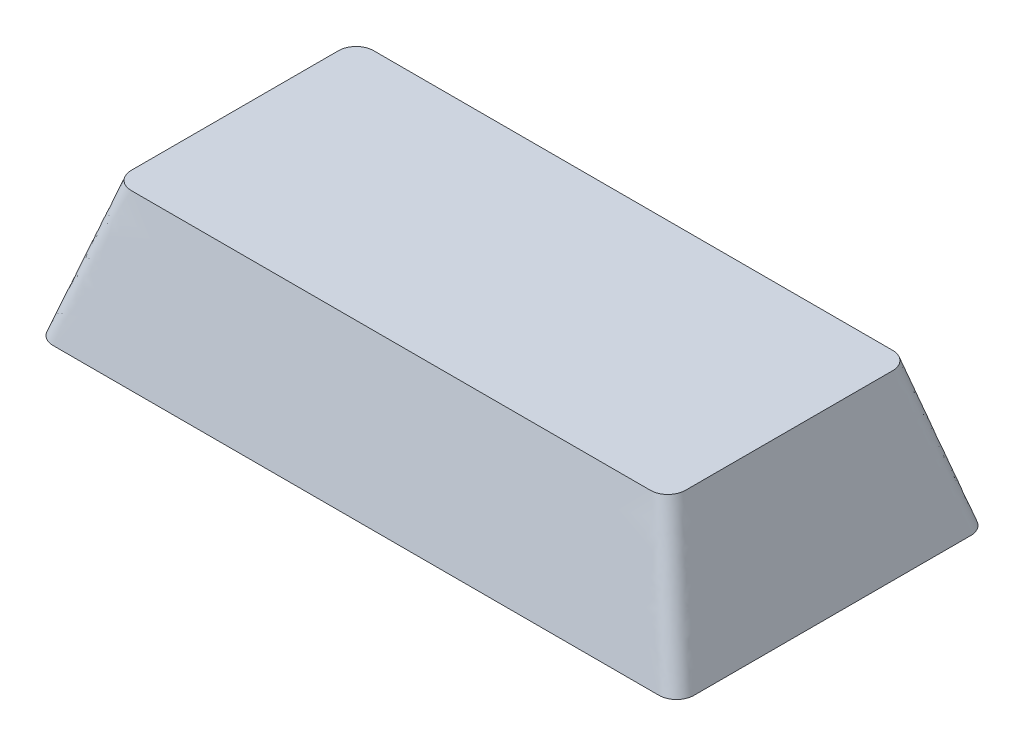
ISO-10303-21;
HEADER;
FILE_DESCRIPTION(('STEP AP214'),'2;1');
FILE_NAME('part.step','',(''),(''),'','','');
FILE_SCHEMA(('AUTOMOTIVE_DESIGN { 1 0 10303 214 1 1 1 1 }'));
ENDSEC;
DATA;
#1=APPLICATION_CONTEXT('core data for automotive mechanical design processes');
#2=APPLICATION_PROTOCOL_DEFINITION('international standard','automotive_design',2000,#1);
#3=PRODUCT_CONTEXT('',#1,'mechanical');
#4=PRODUCT('Part','Part','',(#3));
#5=PRODUCT_RELATED_PRODUCT_CATEGORY('part','',(#4));
#6=PRODUCT_DEFINITION_FORMATION('','',#4);
#7=PRODUCT_DEFINITION_CONTEXT('part definition',#1,'design');
#8=PRODUCT_DEFINITION('design','',#6,#7);
#9=PRODUCT_DEFINITION_SHAPE('','',#8);
#10=(LENGTH_UNIT() NAMED_UNIT(*) SI_UNIT(.MILLI.,.METRE.));
#11=(NAMED_UNIT(*) PLANE_ANGLE_UNIT() SI_UNIT($,.RADIAN.));
#12=(NAMED_UNIT(*) SI_UNIT($,.STERADIAN.) SOLID_ANGLE_UNIT());
#13=UNCERTAINTY_MEASURE_WITH_UNIT(LENGTH_MEASURE(1.E-05),#10,'distance_accuracy_value','');
#14=(GEOMETRIC_REPRESENTATION_CONTEXT(3) GLOBAL_UNCERTAINTY_ASSIGNED_CONTEXT((#13)) GLOBAL_UNIT_ASSIGNED_CONTEXT((#10,
#11,#12)) REPRESENTATION_CONTEXT('',''));
#15=CARTESIAN_POINT('',(0.,0.,0.));
#16=DIRECTION('',(0.,0.,1.));
#17=DIRECTION('',(1.,0.,0.));
#18=AXIS2_PLACEMENT_3D('',#15,#16,#17);
#19=CARTESIAN_POINT('',(-17.4879,0.,-7.9883));
#20=DIRECTION('',(0.,-1.,0.));
#21=DIRECTION('',(0.,0.,-1.));
#22=AXIS2_PLACEMENT_3D('',#19,#20,#21);
#23=PLANE('',#22);
#24=CARTESIAN_POINT('',(-17.4879,0.,-7.9883));
#25=DIRECTION('',(0.,1.,0.));
#26=DIRECTION('',(0.,0.,-1.));
#27=AXIS2_PLACEMENT_3D('',#24,#25,#26);
#28=CIRCLE('',#27,1.016);
#29=CARTESIAN_POINT('',(-17.4878999999086,0.,-9.0043));
#30=VERTEX_POINT('',#29);
#31=CARTESIAN_POINT('',(-18.5039,0.,-7.9883));
#32=VERTEX_POINT('',#31);
#33=EDGE_CURVE('E309',#30,#32,#28,.T.);
#34=ORIENTED_EDGE('',*,*,#33,.F.);
#35=DIRECTION('',(-1.,0.,0.));
#36=VECTOR('',#35,1.);
#37=CARTESIAN_POINT('',(-17.4879,0.,-9.0043));
#38=LINE('',#37,#36);
#39=CARTESIAN_POINT('',(17.4879,0.,-9.0043));
#40=VERTEX_POINT('',#39);
#41=EDGE_CURVE('E541',#40,#30,#38,.T.);
#42=ORIENTED_EDGE('',*,*,#41,.F.);
#43=CARTESIAN_POINT('',(17.4879,0.,-7.9883));
#44=DIRECTION('',(0.,1.,0.));
#45=DIRECTION('',(0.,0.,-1.));
#46=AXIS2_PLACEMENT_3D('',#43,#44,#45);
#47=CIRCLE('',#46,1.016);
#48=CARTESIAN_POINT('',(18.5039,0.,-7.98829999994933));
#49=VERTEX_POINT('',#48);
#50=EDGE_CURVE('E532',#49,#40,#47,.T.);
#51=ORIENTED_EDGE('',*,*,#50,.F.);
#52=DIRECTION('',(0.,0.,-1.));
#53=VECTOR('',#52,1.);
#54=CARTESIAN_POINT('',(18.5039,0.,7.9883));
#55=LINE('',#54,#53);
#56=CARTESIAN_POINT('',(18.5039,0.,7.98829999995141));
#57=VERTEX_POINT('',#56);
#58=EDGE_CURVE('E523',#57,#49,#55,.T.);
#59=ORIENTED_EDGE('',*,*,#58,.F.);
#60=CARTESIAN_POINT('',(17.4879,0.,7.9883));
#61=DIRECTION('',(0.,1.,0.));
#62=DIRECTION('',(0.,0.,1.));
#63=AXIS2_PLACEMENT_3D('',#60,#61,#62);
#64=CIRCLE('',#63,1.016);
#65=CARTESIAN_POINT('',(17.4878999999093,0.,9.0043));
#66=VERTEX_POINT('',#65);
#67=EDGE_CURVE('E514',#66,#57,#64,.T.);
#68=ORIENTED_EDGE('',*,*,#67,.F.);
#69=DIRECTION('',(1.,0.,0.));
#70=VECTOR('',#69,1.);
#71=CARTESIAN_POINT('',(-17.4879,0.,9.0043));
#72=LINE('',#71,#70);
#73=CARTESIAN_POINT('',(-17.4879,0.,9.0043));
#74=VERTEX_POINT('',#73);
#75=EDGE_CURVE('E508',#74,#66,#72,.T.);
#76=ORIENTED_EDGE('',*,*,#75,.F.);
#77=CARTESIAN_POINT('',(-17.4879,0.,7.9883));
#78=DIRECTION('',(0.,1.,0.));
#79=DIRECTION('',(0.,0.,-1.));
#80=AXIS2_PLACEMENT_3D('',#77,#78,#79);
#81=CIRCLE('',#80,1.016);
#82=CARTESIAN_POINT('',(-18.5039,0.,7.9883));
#83=VERTEX_POINT('',#82);
#84=EDGE_CURVE('E242',#83,#74,#81,.T.);
#85=ORIENTED_EDGE('',*,*,#84,.F.);
#86=DIRECTION('',(0.,0.,1.));
#87=VECTOR('',#86,1.);
#88=CARTESIAN_POINT('',(-18.5039,0.,7.9883));
#89=LINE('',#88,#87);
#90=EDGE_CURVE('E12',#32,#83,#89,.T.);
#91=ORIENTED_EDGE('',*,*,#90,.F.);
#92=EDGE_LOOP('',(#34,#42,#51,#59,#68,#76,#85,#91));
#93=FACE_BOUND('',#92,.T.);
#94=ADVANCED_FACE('F232',(#93),#23,.T.);
#95=CARTESIAN_POINT('',(14.986,8.001,-5.9817));
#96=DIRECTION('',(0.,-1.,0.));
#97=DIRECTION('',(0.,0.,-1.));
#98=AXIS2_PLACEMENT_3D('',#95,#96,#97);
#99=PLANE('',#98);
#100=CARTESIAN_POINT('',(14.986,8.001,-5.9817));
#101=DIRECTION('',(0.,1.,0.));
#102=DIRECTION('',(0.,0.,-1.));
#103=AXIS2_PLACEMENT_3D('',#100,#101,#102);
#104=CIRCLE('',#103,1.016);
#105=CARTESIAN_POINT('',(16.002,8.001,-5.9817));
#106=VERTEX_POINT('',#105);
#107=CARTESIAN_POINT('',(14.986,8.001,-6.9977));
#108=VERTEX_POINT('',#107);
#109=EDGE_CURVE('E305',#106,#108,#104,.T.);
#110=ORIENTED_EDGE('',*,*,#109,.T.);
#111=DIRECTION('',(-1.,0.,0.));
#112=VECTOR('',#111,1.);
#113=CARTESIAN_POINT('',(-14.986,8.001,-6.9977));
#114=LINE('',#113,#112);
#115=CARTESIAN_POINT('',(-14.986,8.001,-6.9977));
#116=VERTEX_POINT('',#115);
#117=EDGE_CURVE('E297',#108,#116,#114,.T.);
#118=ORIENTED_EDGE('',*,*,#117,.T.);
#119=CARTESIAN_POINT('',(-14.986,8.001,-5.9817));
#120=DIRECTION('',(0.,1.,0.));
#121=DIRECTION('',(0.,0.,-1.));
#122=AXIS2_PLACEMENT_3D('',#119,#120,#121);
#123=CIRCLE('',#122,1.016);
#124=CARTESIAN_POINT('',(-16.002,8.001,-5.9817));
#125=VERTEX_POINT('',#124);
#126=EDGE_CURVE('E301',#116,#125,#123,.T.);
#127=ORIENTED_EDGE('',*,*,#126,.T.);
#128=DIRECTION('',(0.,0.,1.));
#129=VECTOR('',#128,1.);
#130=CARTESIAN_POINT('',(-16.002,8.001,5.9817));
#131=LINE('',#130,#129);
#132=CARTESIAN_POINT('',(-16.002,8.001,5.9817));
#133=VERTEX_POINT('',#132);
#134=EDGE_CURVE('E316',#125,#133,#131,.T.);
#135=ORIENTED_EDGE('',*,*,#134,.T.);
#136=CARTESIAN_POINT('',(-14.986,8.001,5.9817));
#137=DIRECTION('',(0.,1.,0.));
#138=DIRECTION('',(0.,0.,-1.));
#139=AXIS2_PLACEMENT_3D('',#136,#137,#138);
#140=CIRCLE('',#139,1.016);
#141=CARTESIAN_POINT('',(-14.986,8.001,6.9977));
#142=VERTEX_POINT('',#141);
#143=EDGE_CURVE('E440',#133,#142,#140,.T.);
#144=ORIENTED_EDGE('',*,*,#143,.T.);
#145=DIRECTION('',(1.,0.,0.));
#146=VECTOR('',#145,1.);
#147=CARTESIAN_POINT('',(-14.986,8.001,6.9977));
#148=LINE('',#147,#146);
#149=CARTESIAN_POINT('',(14.986,8.001,6.9977));
#150=VERTEX_POINT('',#149);
#151=EDGE_CURVE('E457',#142,#150,#148,.T.);
#152=ORIENTED_EDGE('',*,*,#151,.T.);
#153=CARTESIAN_POINT('',(14.986,8.001,5.9817));
#154=DIRECTION('',(0.,1.,0.));
#155=DIRECTION('',(0.,0.,1.));
#156=AXIS2_PLACEMENT_3D('',#153,#154,#155);
#157=CIRCLE('',#156,1.016);
#158=CARTESIAN_POINT('',(16.002,8.001,5.9817));
#159=VERTEX_POINT('',#158);
#160=EDGE_CURVE('E460',#150,#159,#157,.T.);
#161=ORIENTED_EDGE('',*,*,#160,.T.);
#162=DIRECTION('',(0.,0.,-1.));
#163=VECTOR('',#162,1.);
#164=CARTESIAN_POINT('',(16.002,8.001,5.9817));
#165=LINE('',#164,#163);
#166=EDGE_CURVE('E478',#159,#106,#165,.T.);
#167=ORIENTED_EDGE('',*,*,#166,.T.);
#168=EDGE_LOOP('',(#110,#118,#127,#135,#144,#152,#161,#167));
#169=FACE_BOUND('',#168,.T.);
#170=ADVANCED_FACE('F300',(#169),#99,.F.);
#171=CARTESIAN_POINT('',(-14.9859999992309,8.001,-6.9977));
#172=CARTESIAN_POINT('',(-17.487899999109,0.,-9.0043));
#173=CARTESIAN_POINT('',(-12.4793944525607,8.001,-6.9977));
#174=CARTESIAN_POINT('',(-14.583974982815,0.,-9.0043));
#175=CARTESIAN_POINT('',(-7.47966242950588,8.001,-6.99770000000001));
#176=CARTESIAN_POINT('',(-8.76012541460544,0.,-9.0043));
#177=CARTESIAN_POINT('',(0.,8.001,-6.9977));
#178=CARTESIAN_POINT('',(0.,0.,-9.0043));
#179=CARTESIAN_POINT('',(7.47966242950587,8.001,-6.99770000000001));
#180=CARTESIAN_POINT('',(8.76012541460545,0.,-9.0043));
#181=CARTESIAN_POINT('',(12.4793944525607,8.001,-6.9977));
#182=CARTESIAN_POINT('',(14.583974982815,0.,-9.0043));
#183=CARTESIAN_POINT('',(15.1100552074222,8.001,-6.9977));
#184=CARTESIAN_POINT('',(17.6316190708819,0.,-9.0043));
#185=CARTESIAN_POINT('',(15.3747789359019,8.001,-6.95141279838868));
#186=CARTESIAN_POINT('',(17.8962710752403,0.,-8.94498696032182));
#187=CARTESIAN_POINT('',(15.736762696106,8.00099999999999,-6.71091647743277));
#188=CARTESIAN_POINT('',(18.2157280945513,0.,-8.73070521446036));
#189=CARTESIAN_POINT('',(15.9610882570955,8.00100000000001,-6.35019499486642));
#190=CARTESIAN_POINT('',(18.4384741679851,0.,-8.4127123608167));
#191=CARTESIAN_POINT('',(16.002,8.001,-6.09892242167773));
#192=CARTESIAN_POINT('',(18.5039,0.,-8.1402171341017));
#193=CARTESIAN_POINT('',(16.002,8.001,-4.96897833343848));
#194=CARTESIAN_POINT('',(18.5039,0.,-6.67583971275487));
#195=CARTESIAN_POINT('',(16.002,8.001,-2.96773738043699));
#196=CARTESIAN_POINT('',(18.5039,0.,-4.02314056568268));
#197=CARTESIAN_POINT('',(16.002,8.001,0.));
#198=CARTESIAN_POINT('',(18.5039,0.,0.));
#199=CARTESIAN_POINT('',(16.002,8.001,2.96773738043699));
#200=CARTESIAN_POINT('',(18.5039,0.,4.02314056568268));
#201=CARTESIAN_POINT('',(16.002,8.001,4.96897833343848));
#202=CARTESIAN_POINT('',(18.5039,0.,6.67583971275486));
#203=CARTESIAN_POINT('',(16.002,8.001,6.09892242167773));
#204=CARTESIAN_POINT('',(18.5039,0.,8.1402171341017));
#205=CARTESIAN_POINT('',(15.9610882570955,8.00100000000001,6.35019499486643));
#206=CARTESIAN_POINT('',(18.438474167985,0.,8.4127123608167));
#207=CARTESIAN_POINT('',(15.736762696106,8.00099999999999,6.71091647743277));
#208=CARTESIAN_POINT('',(18.2157280945514,0.,8.73070521446036));
#209=CARTESIAN_POINT('',(15.3747789359019,8.001,6.95141279838868));
#210=CARTESIAN_POINT('',(17.8962710752403,0.,8.94498696032182));
#211=CARTESIAN_POINT('',(15.1100552074222,8.001,6.9977));
#212=CARTESIAN_POINT('',(17.6316190708819,0.,9.0043));
#213=CARTESIAN_POINT('',(12.4793944525607,8.001,6.9977));
#214=CARTESIAN_POINT('',(14.583974982815,0.,9.0043));
#215=CARTESIAN_POINT('',(7.47966242950587,8.001,6.99770000000001));
#216=CARTESIAN_POINT('',(8.76012541460545,0.,9.0043));
#217=CARTESIAN_POINT('',(0.,8.00099999999999,6.99769999999999));
#218=CARTESIAN_POINT('',(0.,0.,9.0043));
#219=CARTESIAN_POINT('',(-7.47966242950587,8.001,6.99770000000001));
#220=CARTESIAN_POINT('',(-8.76012541460547,0.,9.00430000000001));
#221=CARTESIAN_POINT('',(-12.4793944525607,8.001,6.9977));
#222=CARTESIAN_POINT('',(-14.583974982815,0.,9.0043));
#223=CARTESIAN_POINT('',(-15.1100552074222,8.001,6.9977));
#224=CARTESIAN_POINT('',(-17.6316190708819,0.,9.0043));
#225=CARTESIAN_POINT('',(-15.3747789359019,8.00099999999999,6.95141279838868));
#226=CARTESIAN_POINT('',(-17.8962710752403,0.,8.94498696032182));
#227=CARTESIAN_POINT('',(-15.7367626961061,8.00100000000001,6.71091647743278));
#228=CARTESIAN_POINT('',(-18.2157280945513,0.,8.73070521446036));
#229=CARTESIAN_POINT('',(-15.9610882570955,8.00099999999999,6.35019499486643));
#230=CARTESIAN_POINT('',(-18.4384741679851,0.,8.41271236081672));
#231=CARTESIAN_POINT('',(-16.002,8.001,6.09892242167773));
#232=CARTESIAN_POINT('',(-18.5039,0.,8.1402171341017));
#233=CARTESIAN_POINT('',(-16.002,8.001,4.96897833343848));
#234=CARTESIAN_POINT('',(-18.5039,0.,6.67583971275486));
#235=CARTESIAN_POINT('',(-16.002,8.00099999999999,2.96773738043698));
#236=CARTESIAN_POINT('',(-18.5039,0.,4.02314056568268));
#237=CARTESIAN_POINT('',(-16.002,8.001,0.));
#238=CARTESIAN_POINT('',(-18.5039,0.,0.));
#239=CARTESIAN_POINT('',(-16.002,8.001,-2.967737380437));
#240=CARTESIAN_POINT('',(-18.5039,0.,-4.02314056568268));
#241=CARTESIAN_POINT('',(-16.002,8.001,-4.96897833343849));
#242=CARTESIAN_POINT('',(-18.5039,0.,-6.67583971275486));
#243=CARTESIAN_POINT('',(-16.002,8.001,-6.09892242167773));
#244=CARTESIAN_POINT('',(-18.5039,0.,-8.1402171341017));
#245=CARTESIAN_POINT('',(-15.9610882570955,8.001,-6.35019499486642));
#246=CARTESIAN_POINT('',(-18.4384741679851,0.,-8.41271236081669));
#247=CARTESIAN_POINT('',(-15.736762696106,8.001,-6.71091647743277));
#248=CARTESIAN_POINT('',(-18.2157280945513,0.,-8.73070521446038));
#249=CARTESIAN_POINT('',(-15.3747789359019,8.001,-6.95141279838868));
#250=CARTESIAN_POINT('',(-17.8962710752403,0.,-8.94498696032181));
#251=CARTESIAN_POINT('',(-15.1100552074222,8.001,-6.9977));
#252=CARTESIAN_POINT('',(-17.6316190708819,0.,-9.0043));
#253=CARTESIAN_POINT('',(-14.9859999992309,8.001,-6.9977));
#254=CARTESIAN_POINT('',(-17.487899999109,0.,-9.0043));
#255=B_SPLINE_SURFACE_WITH_KNOTS('',3,1,((#171,#172),(#173,#174),(#175,#176),(#177,#178),(#179,
#180),(#181,#182),(#183,#184),(#185,#186),(#187,#188),(#189,#190),(#191,#192),(#193,#194),(#195,
#196),(#197,#198),(#199,#200),(#201,#202),(#203,#204),(#205,#206),(#207,#208),(#209,#210),(#211,
#212),(#213,#214),(#215,#216),(#217,#218),(#219,#220),(#221,#222),(#223,#224),(#225,#226),(#227,
#228),(#229,#230),(#231,#232),(#233,#234),(#235,#236),(#237,#238),(#239,#240),(#241,#242),(#243,
#244),(#245,#246),(#247,#248),(#249,#250),(#251,#252),(#253,#254)),.UNSPECIFIED.,.T.,.F.,.F.,(4,
1,1,1,2,1,1,1,2,1,1,1,2,1,1,1,2,1,1,1,2,1,1,1,2,1,1,1,2,1,1,1,4),(2,2),(0.,0.0818837827371137,
0.163767565474227,0.245651348211341,0.327535130948455,0.331587667147634,0.335640203346813,
0.339692739545992,0.343745275745171,0.378756420609699,0.413767565474228,0.448778710338756,
0.483789855203284,0.487842391402463,0.491894927601642,0.495947463800821,0.5,0.581883782737114,
0.663767565474228,0.745651348211341,0.827535130948455,0.831587667147634,0.835640203346813,
0.839692739545992,0.843745275745171,0.8787564206097,0.913767565474228,0.948778710338756,
0.983789855203284,0.987842391402463,0.991894927601642,0.995947463800821,1.),(0.,1.),.UNSPECIFIED.);
#256=ORIENTED_EDGE('',*,*,#109,.F.);
#257=ORIENTED_EDGE('',*,*,#166,.F.);
#258=ORIENTED_EDGE('',*,*,#160,.F.);
#259=ORIENTED_EDGE('',*,*,#151,.F.);
#260=ORIENTED_EDGE('',*,*,#143,.F.);
#261=ORIENTED_EDGE('',*,*,#134,.F.);
#262=ORIENTED_EDGE('',*,*,#126,.F.);
#263=ORIENTED_EDGE('',*,*,#117,.F.);
#264=EDGE_LOOP('',(#256,#257,#258,#259,#260,#261,#262,#263));
#265=FACE_BOUND('',#264,.T.);
#266=ORIENTED_EDGE('',*,*,#90,.T.);
#267=ORIENTED_EDGE('',*,*,#84,.T.);
#268=ORIENTED_EDGE('',*,*,#75,.T.);
#269=ORIENTED_EDGE('',*,*,#67,.T.);
#270=ORIENTED_EDGE('',*,*,#58,.T.);
#271=ORIENTED_EDGE('',*,*,#50,.T.);
#272=ORIENTED_EDGE('',*,*,#41,.T.);
#273=ORIENTED_EDGE('',*,*,#33,.T.);
#274=EDGE_LOOP('',(#266,#267,#268,#269,#270,#271,#272,#273));
#275=FACE_BOUND('',#274,.T.);
#276=ADVANCED_FACE('F314',(#265,#275),#255,.T.);
#277=CLOSED_SHELL('',(#94,#170,#276));
#278=MANIFOLD_SOLID_BREP('B2',#277);
#279=ADVANCED_BREP_SHAPE_REPRESENTATION('',(#18,#278),#14);
#280=SHAPE_DEFINITION_REPRESENTATION(#9,#279);
ENDSEC;
END-ISO-10303-21;
